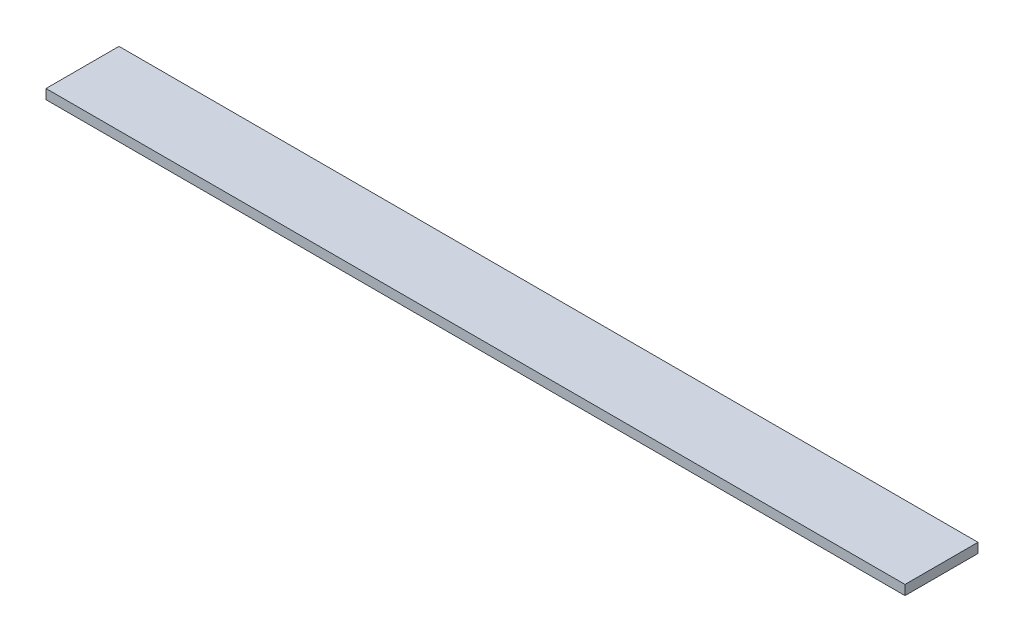
ISO-10303-21;
HEADER;
FILE_DESCRIPTION(('STEP AP214'),'2;1');
FILE_NAME('part.step','',(''),(''),'','','');
FILE_SCHEMA(('AUTOMOTIVE_DESIGN { 1 0 10303 214 1 1 1 1 }'));
ENDSEC;
DATA;
#1=APPLICATION_CONTEXT('core data for automotive mechanical design processes');
#2=APPLICATION_PROTOCOL_DEFINITION('international standard','automotive_design',2000,#1);
#3=PRODUCT_CONTEXT('',#1,'mechanical');
#4=PRODUCT('Part','Part','',(#3));
#5=PRODUCT_RELATED_PRODUCT_CATEGORY('part','',(#4));
#6=PRODUCT_DEFINITION_FORMATION('','',#4);
#7=PRODUCT_DEFINITION_CONTEXT('part definition',#1,'design');
#8=PRODUCT_DEFINITION('design','',#6,#7);
#9=PRODUCT_DEFINITION_SHAPE('','',#8);
#10=(LENGTH_UNIT() NAMED_UNIT(*) SI_UNIT(.MILLI.,.METRE.));
#11=(NAMED_UNIT(*) PLANE_ANGLE_UNIT() SI_UNIT($,.RADIAN.));
#12=(NAMED_UNIT(*) SI_UNIT($,.STERADIAN.) SOLID_ANGLE_UNIT());
#13=UNCERTAINTY_MEASURE_WITH_UNIT(LENGTH_MEASURE(1.E-05),#10,'distance_accuracy_value','');
#14=(GEOMETRIC_REPRESENTATION_CONTEXT(3) GLOBAL_UNCERTAINTY_ASSIGNED_CONTEXT((#13)) GLOBAL_UNIT_ASSIGNED_CONTEXT((#10,
#11,#12)) REPRESENTATION_CONTEXT('',''));
#15=CARTESIAN_POINT('',(0.,0.,0.));
#16=DIRECTION('',(0.,0.,1.));
#17=DIRECTION('',(1.,0.,0.));
#18=AXIS2_PLACEMENT_3D('',#15,#16,#17);
#19=CARTESIAN_POINT('',(353.,-2.,-15.));
#20=DIRECTION('',(0.,0.,1.));
#21=DIRECTION('',(1.,0.,0.));
#22=AXIS2_PLACEMENT_3D('',#19,#20,#21);
#23=PLANE('',#22);
#24=DIRECTION('',(0.,1.,0.));
#25=VECTOR('',#24,1.);
#26=CARTESIAN_POINT('',(0.,-2.,-15.));
#27=LINE('',#26,#25);
#28=CARTESIAN_POINT('',(0.,-2.,-15.));
#29=VERTEX_POINT('',#28);
#30=CARTESIAN_POINT('',(0.,2.,-15.));
#31=VERTEX_POINT('',#30);
#32=EDGE_CURVE('E98',#29,#31,#27,.T.);
#33=ORIENTED_EDGE('',*,*,#32,.T.);
#34=DIRECTION('',(-1.,0.,0.));
#35=VECTOR('',#34,1.);
#36=CARTESIAN_POINT('',(353.,2.,-15.));
#37=LINE('',#36,#35);
#38=CARTESIAN_POINT('',(353.,2.,-15.));
#39=VERTEX_POINT('',#38);
#40=EDGE_CURVE('E11',#39,#31,#37,.T.);
#41=ORIENTED_EDGE('',*,*,#40,.F.);
#42=DIRECTION('',(0.,1.,0.));
#43=VECTOR('',#42,1.);
#44=CARTESIAN_POINT('',(353.,-2.,-15.));
#45=LINE('',#44,#43);
#46=CARTESIAN_POINT('',(353.,-2.,-15.));
#47=VERTEX_POINT('',#46);
#48=EDGE_CURVE('E86',#47,#39,#45,.T.);
#49=ORIENTED_EDGE('',*,*,#48,.F.);
#50=DIRECTION('',(-1.,0.,0.));
#51=VECTOR('',#50,1.);
#52=CARTESIAN_POINT('',(353.,-2.,-15.));
#53=LINE('',#52,#51);
#54=EDGE_CURVE('E94',#47,#29,#53,.T.);
#55=ORIENTED_EDGE('',*,*,#54,.T.);
#56=EDGE_LOOP('',(#33,#41,#49,#55));
#57=FACE_BOUND('',#56,.T.);
#58=ADVANCED_FACE('F35',(#57),#23,.F.);
#59=CARTESIAN_POINT('',(353.,2.,15.));
#60=DIRECTION('',(0.,-1.,0.));
#61=DIRECTION('',(0.,0.,-1.));
#62=AXIS2_PLACEMENT_3D('',#59,#60,#61);
#63=PLANE('',#62);
#64=DIRECTION('',(0.,0.,1.));
#65=VECTOR('',#64,1.);
#66=CARTESIAN_POINT('',(0.,2.,15.));
#67=LINE('',#66,#65);
#68=CARTESIAN_POINT('',(0.,2.,15.));
#69=VERTEX_POINT('',#68);
#70=EDGE_CURVE('E90',#31,#69,#67,.T.);
#71=ORIENTED_EDGE('',*,*,#70,.T.);
#72=DIRECTION('',(-1.,0.,0.));
#73=VECTOR('',#72,1.);
#74=CARTESIAN_POINT('',(353.,2.,15.));
#75=LINE('',#74,#73);
#76=CARTESIAN_POINT('',(353.,2.,15.));
#77=VERTEX_POINT('',#76);
#78=EDGE_CURVE('E43',#77,#69,#75,.T.);
#79=ORIENTED_EDGE('',*,*,#78,.F.);
#80=DIRECTION('',(0.,0.,1.));
#81=VECTOR('',#80,1.);
#82=CARTESIAN_POINT('',(353.,2.,15.));
#83=LINE('',#82,#81);
#84=EDGE_CURVE('E81',#39,#77,#83,.T.);
#85=ORIENTED_EDGE('',*,*,#84,.F.);
#86=ORIENTED_EDGE('',*,*,#40,.T.);
#87=EDGE_LOOP('',(#71,#79,#85,#86));
#88=FACE_BOUND('',#87,.T.);
#89=ADVANCED_FACE('F89',(#88),#63,.F.);
#90=CARTESIAN_POINT('',(353.,-2.,15.));
#91=DIRECTION('',(0.,0.,-1.));
#92=DIRECTION('',(-1.,0.,0.));
#93=AXIS2_PLACEMENT_3D('',#90,#91,#92);
#94=PLANE('',#93);
#95=DIRECTION('',(0.,-1.,0.));
#96=VECTOR('',#95,1.);
#97=CARTESIAN_POINT('',(0.,-2.,15.));
#98=LINE('',#97,#96);
#99=CARTESIAN_POINT('',(0.,-2.,15.));
#100=VERTEX_POINT('',#99);
#101=EDGE_CURVE('E68',#69,#100,#98,.T.);
#102=ORIENTED_EDGE('',*,*,#101,.T.);
#103=DIRECTION('',(-1.,0.,0.));
#104=VECTOR('',#103,1.);
#105=CARTESIAN_POINT('',(353.,-2.,15.));
#106=LINE('',#105,#104);
#107=CARTESIAN_POINT('',(353.,-2.,15.));
#108=VERTEX_POINT('',#107);
#109=EDGE_CURVE('E91',#108,#100,#106,.T.);
#110=ORIENTED_EDGE('',*,*,#109,.F.);
#111=DIRECTION('',(0.,-1.,0.));
#112=VECTOR('',#111,1.);
#113=CARTESIAN_POINT('',(353.,-2.,15.));
#114=LINE('',#113,#112);
#115=EDGE_CURVE('E84',#77,#108,#114,.T.);
#116=ORIENTED_EDGE('',*,*,#115,.F.);
#117=ORIENTED_EDGE('',*,*,#78,.T.);
#118=EDGE_LOOP('',(#102,#110,#116,#117));
#119=FACE_BOUND('',#118,.T.);
#120=ADVANCED_FACE('F92',(#119),#94,.F.);
#121=CARTESIAN_POINT('',(353.,-2.,15.));
#122=DIRECTION('',(0.,1.,0.));
#123=DIRECTION('',(0.,0.,1.));
#124=AXIS2_PLACEMENT_3D('',#121,#122,#123);
#125=PLANE('',#124);
#126=DIRECTION('',(0.,0.,-1.));
#127=VECTOR('',#126,1.);
#128=CARTESIAN_POINT('',(0.,-2.,15.));
#129=LINE('',#128,#127);
#130=EDGE_CURVE('E74',#100,#29,#129,.T.);
#131=ORIENTED_EDGE('',*,*,#130,.T.);
#132=ORIENTED_EDGE('',*,*,#54,.F.);
#133=DIRECTION('',(0.,0.,-1.));
#134=VECTOR('',#133,1.);
#135=CARTESIAN_POINT('',(353.,-2.,15.));
#136=LINE('',#135,#134);
#137=EDGE_CURVE('E51',#108,#47,#136,.T.);
#138=ORIENTED_EDGE('',*,*,#137,.F.);
#139=ORIENTED_EDGE('',*,*,#109,.T.);
#140=EDGE_LOOP('',(#131,#132,#138,#139));
#141=FACE_BOUND('',#140,.T.);
#142=ADVANCED_FACE('F105',(#141),#125,.F.);
#143=CARTESIAN_POINT('',(353.,0.,0.));
#144=DIRECTION('',(-1.,0.,0.));
#145=DIRECTION('',(0.,0.,1.));
#146=AXIS2_PLACEMENT_3D('',#143,#144,#145);
#147=PLANE('',#146);
#148=ORIENTED_EDGE('',*,*,#48,.T.);
#149=ORIENTED_EDGE('',*,*,#84,.T.);
#150=ORIENTED_EDGE('',*,*,#115,.T.);
#151=ORIENTED_EDGE('',*,*,#137,.T.);
#152=EDGE_LOOP('',(#148,#149,#150,#151));
#153=FACE_BOUND('',#152,.T.);
#154=ADVANCED_FACE('F82',(#153),#147,.F.);
#155=CARTESIAN_POINT('',(0.,0.,0.));
#156=DIRECTION('',(-1.,0.,0.));
#157=DIRECTION('',(0.,0.,1.));
#158=AXIS2_PLACEMENT_3D('',#155,#156,#157);
#159=PLANE('',#158);
#160=ORIENTED_EDGE('',*,*,#32,.F.);
#161=ORIENTED_EDGE('',*,*,#130,.F.);
#162=ORIENTED_EDGE('',*,*,#101,.F.);
#163=ORIENTED_EDGE('',*,*,#70,.F.);
#164=EDGE_LOOP('',(#160,#161,#162,#163));
#165=FACE_BOUND('',#164,.T.);
#166=ADVANCED_FACE('F108',(#165),#159,.T.);
#167=CLOSED_SHELL('',(#58,#89,#120,#142,#154,#166));
#168=MANIFOLD_SOLID_BREP('B2',#167);
#169=ADVANCED_BREP_SHAPE_REPRESENTATION('',(#18,#168),#14);
#170=SHAPE_DEFINITION_REPRESENTATION(#9,#169);
ENDSEC;
END-ISO-10303-21;
